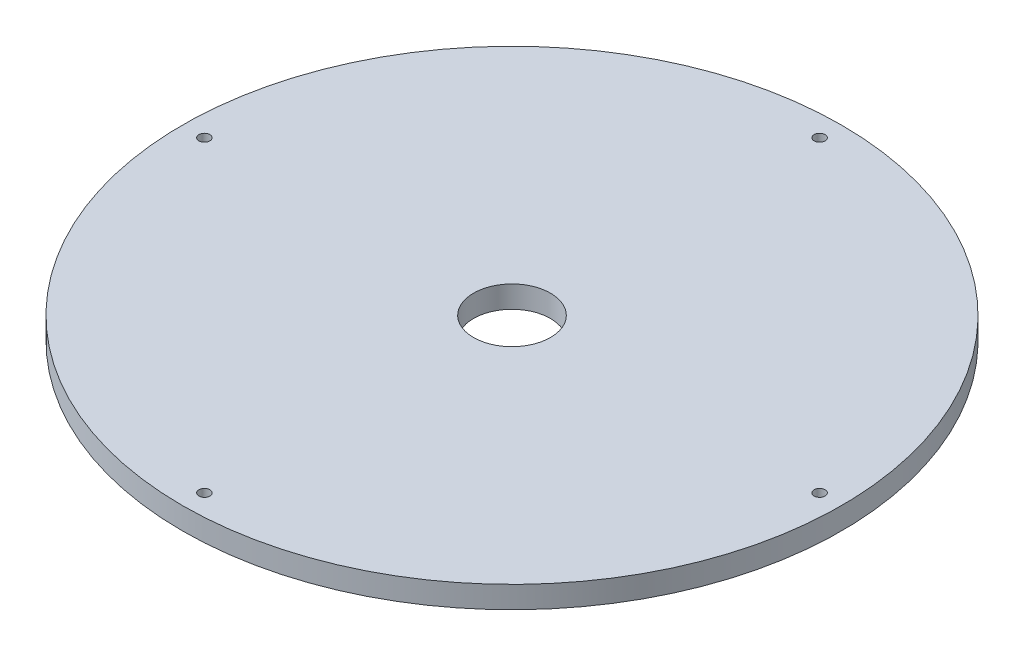
ISO-10303-21;
HEADER;
FILE_DESCRIPTION(('STEP AP214'),'2;1');
FILE_NAME('part.step','',(''),(''),'','','');
FILE_SCHEMA(('AUTOMOTIVE_DESIGN { 1 0 10303 214 1 1 1 1 }'));
ENDSEC;
DATA;
#1=APPLICATION_CONTEXT('core data for automotive mechanical design processes');
#2=APPLICATION_PROTOCOL_DEFINITION('international standard','automotive_design',2000,#1);
#3=PRODUCT_CONTEXT('',#1,'mechanical');
#4=PRODUCT('Part','Part','',(#3));
#5=PRODUCT_RELATED_PRODUCT_CATEGORY('part','',(#4));
#6=PRODUCT_DEFINITION_FORMATION('','',#4);
#7=PRODUCT_DEFINITION_CONTEXT('part definition',#1,'design');
#8=PRODUCT_DEFINITION('design','',#6,#7);
#9=PRODUCT_DEFINITION_SHAPE('','',#8);
#10=(LENGTH_UNIT() NAMED_UNIT(*) SI_UNIT(.MILLI.,.METRE.));
#11=(NAMED_UNIT(*) PLANE_ANGLE_UNIT() SI_UNIT($,.RADIAN.));
#12=(NAMED_UNIT(*) SI_UNIT($,.STERADIAN.) SOLID_ANGLE_UNIT());
#13=UNCERTAINTY_MEASURE_WITH_UNIT(LENGTH_MEASURE(1.E-05),#10,'distance_accuracy_value','');
#14=(GEOMETRIC_REPRESENTATION_CONTEXT(3) GLOBAL_UNCERTAINTY_ASSIGNED_CONTEXT((#13)) GLOBAL_UNIT_ASSIGNED_CONTEXT((#10,
#11,#12)) REPRESENTATION_CONTEXT('',''));
#15=CARTESIAN_POINT('',(0.,0.,0.));
#16=DIRECTION('',(0.,0.,1.));
#17=DIRECTION('',(1.,0.,0.));
#18=AXIS2_PLACEMENT_3D('',#15,#16,#17);
#19=CARTESIAN_POINT('',(0.,10.,0.));
#20=DIRECTION('',(0.,1.,0.));
#21=DIRECTION('',(0.,0.,1.));
#22=AXIS2_PLACEMENT_3D('',#19,#20,#21);
#23=PLANE('',#22);
#24=CARTESIAN_POINT('',(140.,10.,9.77614774876077E-13));
#25=DIRECTION('',(0.,1.,0.));
#26=DIRECTION('',(0.,0.,1.));
#27=AXIS2_PLACEMENT_3D('',#24,#25,#26);
#28=CIRCLE('',#27,2.49999999999999);
#29=CARTESIAN_POINT('',(140.,10.,2.50000000000097));
#30=VERTEX_POINT('',#29);
#31=EDGE_CURVE('E72',#30,#30,#28,.T.);
#32=ORIENTED_EDGE('',*,*,#31,.F.);
#33=EDGE_LOOP('',(#32));
#34=FACE_BOUND('',#33,.T.);
#35=CARTESIAN_POINT('',(-140.,10.,0.));
#36=DIRECTION('',(0.,1.,0.));
#37=DIRECTION('',(0.,0.,1.));
#38=AXIS2_PLACEMENT_3D('',#35,#36,#37);
#39=CIRCLE('',#38,2.49999999999999);
#40=CARTESIAN_POINT('',(-140.,10.,2.49999999999999));
#41=VERTEX_POINT('',#40);
#42=EDGE_CURVE('E56',#41,#41,#39,.T.);
#43=ORIENTED_EDGE('',*,*,#42,.F.);
#44=EDGE_LOOP('',(#43));
#45=FACE_BOUND('',#44,.T.);
#46=CARTESIAN_POINT('',(0.,10.,0.));
#47=DIRECTION('',(0.,1.,0.));
#48=DIRECTION('',(0.,0.,1.));
#49=AXIS2_PLACEMENT_3D('',#46,#47,#48);
#50=CIRCLE('',#49,150.);
#51=CARTESIAN_POINT('',(0.,10.,150.));
#52=VERTEX_POINT('',#51);
#53=EDGE_CURVE('E10',#52,#52,#50,.T.);
#54=ORIENTED_EDGE('',*,*,#53,.T.);
#55=EDGE_LOOP('',(#54));
#56=FACE_BOUND('',#55,.T.);
#57=CARTESIAN_POINT('',(0.,10.,0.));
#58=DIRECTION('',(0.,1.,0.));
#59=DIRECTION('',(0.,0.,1.));
#60=AXIS2_PLACEMENT_3D('',#57,#58,#59);
#61=CIRCLE('',#60,17.5);
#62=CARTESIAN_POINT('',(0.,10.,17.5));
#63=VERTEX_POINT('',#62);
#64=EDGE_CURVE('E50',#63,#63,#61,.T.);
#65=ORIENTED_EDGE('',*,*,#64,.F.);
#66=EDGE_LOOP('',(#65));
#67=FACE_BOUND('',#66,.T.);
#68=CARTESIAN_POINT('',(4.88807387438039E-13,10.,-140.));
#69=DIRECTION('',(0.,1.,0.));
#70=DIRECTION('',(0.,0.,1.));
#71=AXIS2_PLACEMENT_3D('',#68,#69,#70);
#72=CIRCLE('',#71,2.49999999999999);
#73=CARTESIAN_POINT('',(4.88807387438039E-13,10.,-137.5));
#74=VERTEX_POINT('',#73);
#75=EDGE_CURVE('E64',#74,#74,#72,.T.);
#76=ORIENTED_EDGE('',*,*,#75,.F.);
#77=EDGE_LOOP('',(#76));
#78=FACE_BOUND('',#77,.T.);
#79=CARTESIAN_POINT('',(-1.46642216231412E-12,10.,140.));
#80=DIRECTION('',(0.,1.,0.));
#81=DIRECTION('',(0.,0.,1.));
#82=AXIS2_PLACEMENT_3D('',#79,#80,#81);
#83=CIRCLE('',#82,2.49999999999999);
#84=CARTESIAN_POINT('',(-1.46642216231412E-12,10.,142.5));
#85=VERTEX_POINT('',#84);
#86=EDGE_CURVE('E80',#85,#85,#83,.T.);
#87=ORIENTED_EDGE('',*,*,#86,.F.);
#88=EDGE_LOOP('',(#87));
#89=FACE_BOUND('',#88,.T.);
#90=ADVANCED_FACE('F37',(#34,#45,#56,#67,#78,#89),#23,.T.);
#91=CARTESIAN_POINT('',(0.,0.,0.));
#92=DIRECTION('',(0.,1.,0.));
#93=DIRECTION('',(0.,0.,1.));
#94=AXIS2_PLACEMENT_3D('',#91,#92,#93);
#95=PLANE('',#94);
#96=CARTESIAN_POINT('',(0.,0.,0.));
#97=DIRECTION('',(0.,1.,0.));
#98=DIRECTION('',(0.,0.,1.));
#99=AXIS2_PLACEMENT_3D('',#96,#97,#98);
#100=CIRCLE('',#99,150.);
#101=CARTESIAN_POINT('',(0.,0.,150.));
#102=VERTEX_POINT('',#101);
#103=EDGE_CURVE('E41',#102,#102,#100,.T.);
#104=ORIENTED_EDGE('',*,*,#103,.F.);
#105=EDGE_LOOP('',(#104));
#106=FACE_BOUND('',#105,.T.);
#107=CARTESIAN_POINT('',(0.,0.,0.));
#108=DIRECTION('',(0.,1.,0.));
#109=DIRECTION('',(0.,0.,1.));
#110=AXIS2_PLACEMENT_3D('',#107,#108,#109);
#111=CIRCLE('',#110,17.5);
#112=CARTESIAN_POINT('',(0.,0.,17.5));
#113=VERTEX_POINT('',#112);
#114=EDGE_CURVE('E52',#113,#113,#111,.T.);
#115=ORIENTED_EDGE('',*,*,#114,.T.);
#116=EDGE_LOOP('',(#115));
#117=FACE_BOUND('',#116,.T.);
#118=CARTESIAN_POINT('',(-140.,0.,0.));
#119=DIRECTION('',(0.,1.,0.));
#120=DIRECTION('',(0.,0.,1.));
#121=AXIS2_PLACEMENT_3D('',#118,#119,#120);
#122=CIRCLE('',#121,2.49999999999999);
#123=CARTESIAN_POINT('',(-140.,0.,2.49999999999999));
#124=VERTEX_POINT('',#123);
#125=EDGE_CURVE('E60',#124,#124,#122,.T.);
#126=ORIENTED_EDGE('',*,*,#125,.T.);
#127=EDGE_LOOP('',(#126));
#128=FACE_BOUND('',#127,.T.);
#129=CARTESIAN_POINT('',(4.88807387438039E-13,0.,-140.));
#130=DIRECTION('',(0.,1.,0.));
#131=DIRECTION('',(0.,0.,1.));
#132=AXIS2_PLACEMENT_3D('',#129,#130,#131);
#133=CIRCLE('',#132,2.49999999999999);
#134=CARTESIAN_POINT('',(4.88807387438039E-13,0.,-137.5));
#135=VERTEX_POINT('',#134);
#136=EDGE_CURVE('E68',#135,#135,#133,.T.);
#137=ORIENTED_EDGE('',*,*,#136,.T.);
#138=EDGE_LOOP('',(#137));
#139=FACE_BOUND('',#138,.T.);
#140=CARTESIAN_POINT('',(140.,0.,9.77614774876077E-13));
#141=DIRECTION('',(0.,1.,0.));
#142=DIRECTION('',(0.,0.,1.));
#143=AXIS2_PLACEMENT_3D('',#140,#141,#142);
#144=CIRCLE('',#143,2.49999999999999);
#145=CARTESIAN_POINT('',(140.,0.,2.50000000000097));
#146=VERTEX_POINT('',#145);
#147=EDGE_CURVE('E76',#146,#146,#144,.T.);
#148=ORIENTED_EDGE('',*,*,#147,.T.);
#149=EDGE_LOOP('',(#148));
#150=FACE_BOUND('',#149,.T.);
#151=CARTESIAN_POINT('',(-1.46642216231412E-12,0.,140.));
#152=DIRECTION('',(0.,1.,0.));
#153=DIRECTION('',(0.,0.,1.));
#154=AXIS2_PLACEMENT_3D('',#151,#152,#153);
#155=CIRCLE('',#154,2.49999999999999);
#156=CARTESIAN_POINT('',(-1.46642216231412E-12,0.,142.5));
#157=VERTEX_POINT('',#156);
#158=EDGE_CURVE('E84',#157,#157,#155,.T.);
#159=ORIENTED_EDGE('',*,*,#158,.T.);
#160=EDGE_LOOP('',(#159));
#161=FACE_BOUND('',#160,.T.);
#162=ADVANCED_FACE('F96',(#106,#117,#128,#139,#150,#161),#95,.F.);
#163=CARTESIAN_POINT('',(0.,10.,0.));
#164=DIRECTION('',(0.,-1.,0.));
#165=DIRECTION('',(0.,0.,-1.));
#166=AXIS2_PLACEMENT_3D('',#163,#164,#165);
#167=CYLINDRICAL_SURFACE('',#166,150.);
#168=ORIENTED_EDGE('',*,*,#53,.F.);
#169=EDGE_LOOP('',(#168));
#170=FACE_BOUND('',#169,.T.);
#171=ORIENTED_EDGE('',*,*,#103,.T.);
#172=EDGE_LOOP('',(#171));
#173=FACE_BOUND('',#172,.T.);
#174=ADVANCED_FACE('F39',(#170,#173),#167,.T.);
#175=CARTESIAN_POINT('',(0.,10.,0.));
#176=DIRECTION('',(0.,-1.,0.));
#177=DIRECTION('',(0.,0.,-1.));
#178=AXIS2_PLACEMENT_3D('',#175,#176,#177);
#179=CYLINDRICAL_SURFACE('',#178,17.5);
#180=ORIENTED_EDGE('',*,*,#64,.T.);
#181=EDGE_LOOP('',(#180));
#182=FACE_BOUND('',#181,.T.);
#183=ORIENTED_EDGE('',*,*,#114,.F.);
#184=EDGE_LOOP('',(#183));
#185=FACE_BOUND('',#184,.T.);
#186=ADVANCED_FACE('F106',(#182,#185),#179,.F.);
#187=CARTESIAN_POINT('',(-140.,10.,0.));
#188=DIRECTION('',(0.,-1.,0.));
#189=DIRECTION('',(0.,0.,-1.));
#190=AXIS2_PLACEMENT_3D('',#187,#188,#189);
#191=CYLINDRICAL_SURFACE('',#190,2.49999999999999);
#192=ORIENTED_EDGE('',*,*,#42,.T.);
#193=EDGE_LOOP('',(#192));
#194=FACE_BOUND('',#193,.T.);
#195=ORIENTED_EDGE('',*,*,#125,.F.);
#196=EDGE_LOOP('',(#195));
#197=FACE_BOUND('',#196,.T.);
#198=ADVANCED_FACE('F109',(#194,#197),#191,.F.);
#199=CARTESIAN_POINT('',(4.88807387438039E-13,10.,-140.));
#200=DIRECTION('',(0.,-1.,0.));
#201=DIRECTION('',(0.,0.,-1.));
#202=AXIS2_PLACEMENT_3D('',#199,#200,#201);
#203=CYLINDRICAL_SURFACE('',#202,2.49999999999999);
#204=ORIENTED_EDGE('',*,*,#75,.T.);
#205=EDGE_LOOP('',(#204));
#206=FACE_BOUND('',#205,.T.);
#207=ORIENTED_EDGE('',*,*,#136,.F.);
#208=EDGE_LOOP('',(#207));
#209=FACE_BOUND('',#208,.T.);
#210=ADVANCED_FACE('F113',(#206,#209),#203,.F.);
#211=CARTESIAN_POINT('',(140.,10.,9.77614774876077E-13));
#212=DIRECTION('',(0.,-1.,0.));
#213=DIRECTION('',(0.,0.,-1.));
#214=AXIS2_PLACEMENT_3D('',#211,#212,#213);
#215=CYLINDRICAL_SURFACE('',#214,2.49999999999999);
#216=ORIENTED_EDGE('',*,*,#31,.T.);
#217=EDGE_LOOP('',(#216));
#218=FACE_BOUND('',#217,.T.);
#219=ORIENTED_EDGE('',*,*,#147,.F.);
#220=EDGE_LOOP('',(#219));
#221=FACE_BOUND('',#220,.T.);
#222=ADVANCED_FACE('F117',(#218,#221),#215,.F.);
#223=CARTESIAN_POINT('',(-1.46642216231412E-12,10.,140.));
#224=DIRECTION('',(0.,-1.,0.));
#225=DIRECTION('',(0.,0.,-1.));
#226=AXIS2_PLACEMENT_3D('',#223,#224,#225);
#227=CYLINDRICAL_SURFACE('',#226,2.49999999999999);
#228=ORIENTED_EDGE('',*,*,#86,.T.);
#229=EDGE_LOOP('',(#228));
#230=FACE_BOUND('',#229,.T.);
#231=ORIENTED_EDGE('',*,*,#158,.F.);
#232=EDGE_LOOP('',(#231));
#233=FACE_BOUND('',#232,.T.);
#234=ADVANCED_FACE('F92',(#230,#233),#227,.F.);
#235=CLOSED_SHELL('',(#90,#162,#174,#186,#198,#210,#222,#234));
#236=MANIFOLD_SOLID_BREP('B2',#235);
#237=ADVANCED_BREP_SHAPE_REPRESENTATION('',(#18,#236),#14);
#238=SHAPE_DEFINITION_REPRESENTATION(#9,#237);
ENDSEC;
END-ISO-10303-21;
